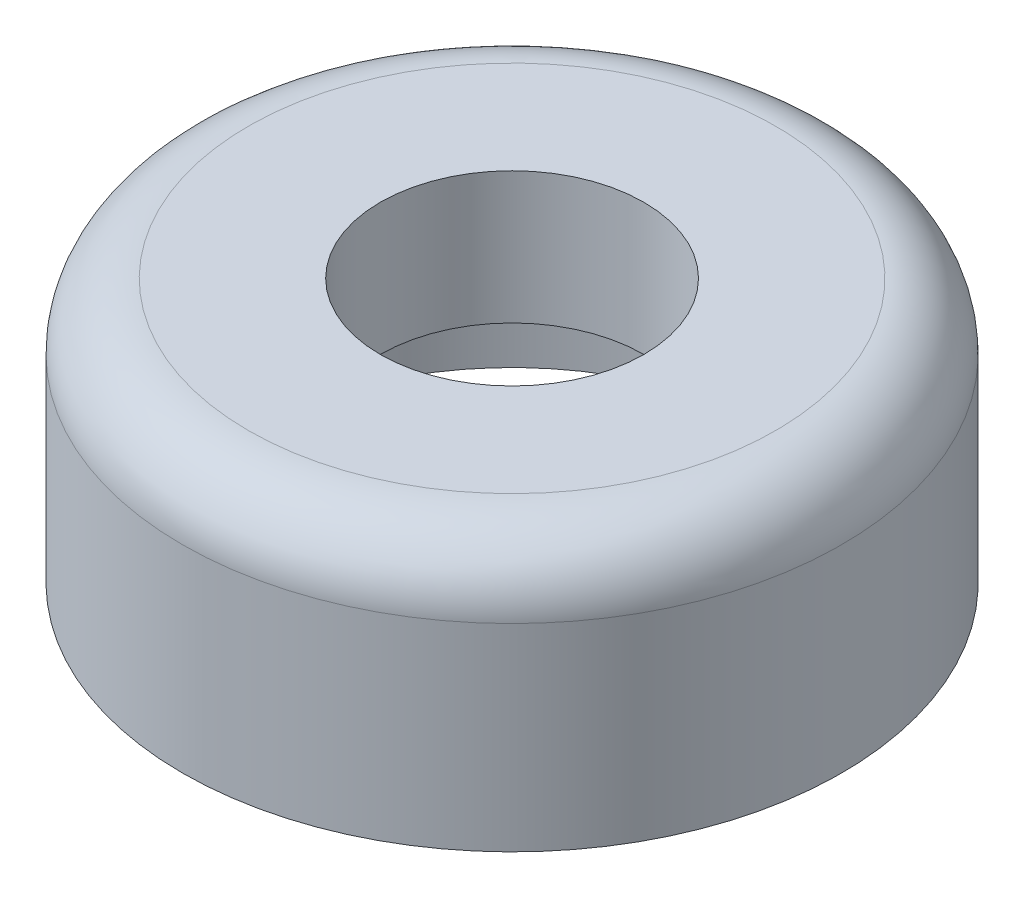
ISO-10303-21;
HEADER;
FILE_DESCRIPTION(('STEP AP214'),'2;1');
FILE_NAME('part.step','',(''),(''),'','','');
FILE_SCHEMA(('AUTOMOTIVE_DESIGN { 1 0 10303 214 1 1 1 1 }'));
ENDSEC;
DATA;
#1=APPLICATION_CONTEXT('core data for automotive mechanical design processes');
#2=APPLICATION_PROTOCOL_DEFINITION('international standard','automotive_design',2000,#1);
#3=PRODUCT_CONTEXT('',#1,'mechanical');
#4=PRODUCT('Part','Part','',(#3));
#5=PRODUCT_RELATED_PRODUCT_CATEGORY('part','',(#4));
#6=PRODUCT_DEFINITION_FORMATION('','',#4);
#7=PRODUCT_DEFINITION_CONTEXT('part definition',#1,'design');
#8=PRODUCT_DEFINITION('design','',#6,#7);
#9=PRODUCT_DEFINITION_SHAPE('','',#8);
#10=(LENGTH_UNIT() NAMED_UNIT(*) SI_UNIT(.MILLI.,.METRE.));
#11=(NAMED_UNIT(*) PLANE_ANGLE_UNIT() SI_UNIT($,.RADIAN.));
#12=(NAMED_UNIT(*) SI_UNIT($,.STERADIAN.) SOLID_ANGLE_UNIT());
#13=UNCERTAINTY_MEASURE_WITH_UNIT(LENGTH_MEASURE(1.E-05),#10,'distance_accuracy_value','');
#14=(GEOMETRIC_REPRESENTATION_CONTEXT(3) GLOBAL_UNCERTAINTY_ASSIGNED_CONTEXT((#13)) GLOBAL_UNIT_ASSIGNED_CONTEXT((#10,
#11,#12)) REPRESENTATION_CONTEXT('',''));
#15=CARTESIAN_POINT('',(0.,0.,0.));
#16=DIRECTION('',(0.,0.,1.));
#17=DIRECTION('',(1.,0.,0.));
#18=AXIS2_PLACEMENT_3D('',#15,#16,#17);
#19=CARTESIAN_POINT('',(50.8,101.6,0.));
#20=DIRECTION('',(0.,1.,0.));
#21=DIRECTION('',(0.,0.,1.));
#22=AXIS2_PLACEMENT_3D('',#19,#20,#21);
#23=PLANE('',#22);
#24=CARTESIAN_POINT('',(0.,101.6,0.));
#25=DIRECTION('',(0.,1.,0.));
#26=DIRECTION('',(0.,0.,1.));
#27=AXIS2_PLACEMENT_3D('',#24,#25,#26);
#28=CIRCLE('',#27,101.6);
#29=CARTESIAN_POINT('',(0.,101.6,101.6));
#30=VERTEX_POINT('',#29);
#31=EDGE_CURVE('E62',#30,#30,#28,.T.);
#32=ORIENTED_EDGE('',*,*,#31,.T.);
#33=EDGE_LOOP('',(#32));
#34=FACE_BOUND('',#33,.T.);
#35=CARTESIAN_POINT('',(0.,101.6,0.));
#36=DIRECTION('',(0.,1.,0.));
#37=DIRECTION('',(0.,0.,1.));
#38=AXIS2_PLACEMENT_3D('',#35,#36,#37);
#39=CIRCLE('',#38,50.8);
#40=CARTESIAN_POINT('',(0.,101.6,50.8));
#41=VERTEX_POINT('',#40);
#42=EDGE_CURVE('E10',#41,#41,#39,.T.);
#43=ORIENTED_EDGE('',*,*,#42,.F.);
#44=EDGE_LOOP('',(#43));
#45=FACE_BOUND('',#44,.T.);
#46=ADVANCED_FACE('F34',(#34,#45),#23,.T.);
#47=CARTESIAN_POINT('',(0.,127.,0.));
#48=DIRECTION('',(0.,1.,0.));
#49=DIRECTION('',(0.,0.,1.));
#50=AXIS2_PLACEMENT_3D('',#47,#48,#49);
#51=CYLINDRICAL_SURFACE('',#50,50.8);
#52=CARTESIAN_POINT('',(0.,50.8,0.));
#53=DIRECTION('',(0.,1.,0.));
#54=DIRECTION('',(0.,0.,1.));
#55=AXIS2_PLACEMENT_3D('',#52,#53,#54);
#56=CIRCLE('',#55,50.8);
#57=CARTESIAN_POINT('',(0.,50.8,50.8));
#58=VERTEX_POINT('',#57);
#59=EDGE_CURVE('E40',#58,#58,#56,.T.);
#60=ORIENTED_EDGE('',*,*,#59,.F.);
#61=EDGE_LOOP('',(#60));
#62=FACE_BOUND('',#61,.T.);
#63=ORIENTED_EDGE('',*,*,#42,.T.);
#64=EDGE_LOOP('',(#63));
#65=FACE_BOUND('',#64,.T.);
#66=ADVANCED_FACE('F86',(#62,#65),#51,.F.);
#67=CARTESIAN_POINT('',(76.2,50.8,0.));
#68=DIRECTION('',(0.,-1.,0.));
#69=DIRECTION('',(0.,0.,-1.));
#70=AXIS2_PLACEMENT_3D('',#67,#68,#69);
#71=PLANE('',#70);
#72=ORIENTED_EDGE('',*,*,#59,.T.);
#73=EDGE_LOOP('',(#72));
#74=FACE_BOUND('',#73,.T.);
#75=CARTESIAN_POINT('',(0.,50.8,0.));
#76=DIRECTION('',(0.,1.,0.));
#77=DIRECTION('',(0.,0.,1.));
#78=AXIS2_PLACEMENT_3D('',#75,#76,#77);
#79=CIRCLE('',#78,76.2);
#80=CARTESIAN_POINT('',(0.,50.8,76.2));
#81=VERTEX_POINT('',#80);
#82=EDGE_CURVE('E44',#81,#81,#79,.T.);
#83=ORIENTED_EDGE('',*,*,#82,.F.);
#84=EDGE_LOOP('',(#83));
#85=FACE_BOUND('',#84,.T.);
#86=ADVANCED_FACE('F90',(#74,#85),#71,.T.);
#87=CARTESIAN_POINT('',(0.,25.4,0.));
#88=DIRECTION('',(0.,-1.,0.));
#89=DIRECTION('',(0.,0.,-1.));
#90=AXIS2_PLACEMENT_3D('',#87,#88,#89);
#91=CONICAL_SURFACE('',#90,101.6,0.785398163397449);
#92=ORIENTED_EDGE('',*,*,#82,.T.);
#93=EDGE_LOOP('',(#92));
#94=FACE_BOUND('',#93,.T.);
#95=CARTESIAN_POINT('',(0.,25.4,0.));
#96=DIRECTION('',(0.,1.,0.));
#97=DIRECTION('',(0.,0.,1.));
#98=AXIS2_PLACEMENT_3D('',#95,#96,#97);
#99=CIRCLE('',#98,101.6);
#100=CARTESIAN_POINT('',(0.,25.4,101.6));
#101=VERTEX_POINT('',#100);
#102=EDGE_CURVE('E48',#101,#101,#99,.T.);
#103=ORIENTED_EDGE('',*,*,#102,.F.);
#104=EDGE_LOOP('',(#103));
#105=FACE_BOUND('',#104,.T.);
#106=ADVANCED_FACE('F95',(#94,#105),#91,.F.);
#107=CARTESIAN_POINT('',(0.,127.,0.));
#108=DIRECTION('',(0.,1.,0.));
#109=DIRECTION('',(0.,0.,1.));
#110=AXIS2_PLACEMENT_3D('',#107,#108,#109);
#111=CYLINDRICAL_SURFACE('',#110,101.6);
#112=CARTESIAN_POINT('',(0.,0.,0.));
#113=DIRECTION('',(0.,1.,0.));
#114=DIRECTION('',(0.,0.,1.));
#115=AXIS2_PLACEMENT_3D('',#112,#113,#114);
#116=CIRCLE('',#115,101.6);
#117=CARTESIAN_POINT('',(0.,0.,101.6));
#118=VERTEX_POINT('',#117);
#119=EDGE_CURVE('E53',#118,#118,#116,.T.);
#120=ORIENTED_EDGE('',*,*,#119,.F.);
#121=EDGE_LOOP('',(#120));
#122=FACE_BOUND('',#121,.T.);
#123=ORIENTED_EDGE('',*,*,#102,.T.);
#124=EDGE_LOOP('',(#123));
#125=FACE_BOUND('',#124,.T.);
#126=ADVANCED_FACE('F82',(#122,#125),#111,.F.);
#127=CARTESIAN_POINT('',(127.,0.,0.));
#128=DIRECTION('',(0.,-1.,0.));
#129=DIRECTION('',(0.,0.,-1.));
#130=AXIS2_PLACEMENT_3D('',#127,#128,#129);
#131=PLANE('',#130);
#132=ORIENTED_EDGE('',*,*,#119,.T.);
#133=EDGE_LOOP('',(#132));
#134=FACE_BOUND('',#133,.T.);
#135=CARTESIAN_POINT('',(0.,0.,0.));
#136=DIRECTION('',(0.,1.,0.));
#137=DIRECTION('',(0.,0.,1.));
#138=AXIS2_PLACEMENT_3D('',#135,#136,#137);
#139=CIRCLE('',#138,127.);
#140=CARTESIAN_POINT('',(0.,0.,127.));
#141=VERTEX_POINT('',#140);
#142=EDGE_CURVE('E56',#141,#141,#139,.T.);
#143=ORIENTED_EDGE('',*,*,#142,.F.);
#144=EDGE_LOOP('',(#143));
#145=FACE_BOUND('',#144,.T.);
#146=ADVANCED_FACE('F76',(#134,#145),#131,.T.);
#147=CARTESIAN_POINT('',(0.,127.,0.));
#148=DIRECTION('',(0.,1.,0.));
#149=DIRECTION('',(0.,0.,1.));
#150=AXIS2_PLACEMENT_3D('',#147,#148,#149);
#151=CYLINDRICAL_SURFACE('',#150,127.);
#152=ORIENTED_EDGE('',*,*,#142,.T.);
#153=EDGE_LOOP('',(#152));
#154=FACE_BOUND('',#153,.T.);
#155=CARTESIAN_POINT('',(0.,76.1999999999998,0.));
#156=DIRECTION('',(0.,1.,0.));
#157=DIRECTION('',(0.,0.,1.));
#158=AXIS2_PLACEMENT_3D('',#155,#156,#157);
#159=CIRCLE('',#158,127.);
#160=CARTESIAN_POINT('',(0.,76.1999999999998,127.));
#161=VERTEX_POINT('',#160);
#162=EDGE_CURVE('E59',#161,#161,#159,.T.);
#163=ORIENTED_EDGE('',*,*,#162,.F.);
#164=EDGE_LOOP('',(#163));
#165=FACE_BOUND('',#164,.T.);
#166=ADVANCED_FACE('F71',(#154,#165),#151,.T.);
#167=CARTESIAN_POINT('',(0.,76.2,0.));
#168=DIRECTION('',(0.,1.,0.));
#169=DIRECTION('',(0.,0.,1.));
#170=AXIS2_PLACEMENT_3D('',#167,#168,#169);
#171=TOROIDAL_SURFACE('',#170,101.6,25.4);
#172=ORIENTED_EDGE('',*,*,#31,.F.);
#173=EDGE_LOOP('',(#172));
#174=FACE_BOUND('',#173,.T.);
#175=ORIENTED_EDGE('',*,*,#162,.T.);
#176=EDGE_LOOP('',(#175));
#177=FACE_BOUND('',#176,.T.);
#178=ADVANCED_FACE('F68',(#174,#177),#171,.T.);
#179=CLOSED_SHELL('',(#46,#66,#86,#106,#126,#146,#166,#178));
#180=MANIFOLD_SOLID_BREP('B2',#179);
#181=ADVANCED_BREP_SHAPE_REPRESENTATION('',(#18,#180),#14);
#182=SHAPE_DEFINITION_REPRESENTATION(#9,#181);
ENDSEC;
END-ISO-10303-21;
